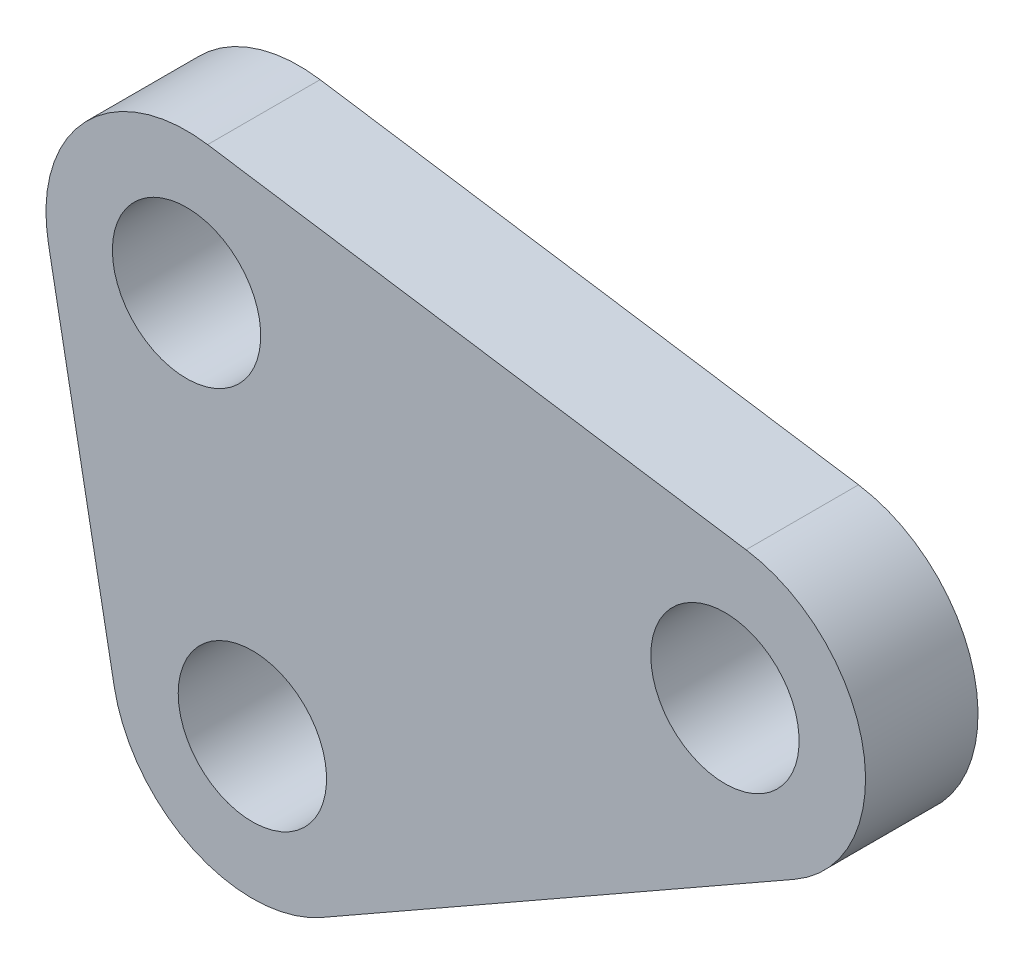
ISO-10303-21;
HEADER;
FILE_DESCRIPTION(('STEP AP214'),'2;1');
FILE_NAME('part.step','',(''),(''),'','','');
FILE_SCHEMA(('AUTOMOTIVE_DESIGN { 1 0 10303 214 1 1 1 1 }'));
ENDSEC;
DATA;
#1=APPLICATION_CONTEXT('core data for automotive mechanical design processes');
#2=APPLICATION_PROTOCOL_DEFINITION('international standard','automotive_design',2000,#1);
#3=PRODUCT_CONTEXT('',#1,'mechanical');
#4=PRODUCT('Part','Part','',(#3));
#5=PRODUCT_RELATED_PRODUCT_CATEGORY('part','',(#4));
#6=PRODUCT_DEFINITION_FORMATION('','',#4);
#7=PRODUCT_DEFINITION_CONTEXT('part definition',#1,'design');
#8=PRODUCT_DEFINITION('design','',#6,#7);
#9=PRODUCT_DEFINITION_SHAPE('','',#8);
#10=(LENGTH_UNIT() NAMED_UNIT(*) SI_UNIT(.MILLI.,.METRE.));
#11=(NAMED_UNIT(*) PLANE_ANGLE_UNIT() SI_UNIT($,.RADIAN.));
#12=(NAMED_UNIT(*) SI_UNIT($,.STERADIAN.) SOLID_ANGLE_UNIT());
#13=UNCERTAINTY_MEASURE_WITH_UNIT(LENGTH_MEASURE(1.E-05),#10,'distance_accuracy_value','');
#14=(GEOMETRIC_REPRESENTATION_CONTEXT(3) GLOBAL_UNCERTAINTY_ASSIGNED_CONTEXT((#13)) GLOBAL_UNIT_ASSIGNED_CONTEXT((#10,
#11,#12)) REPRESENTATION_CONTEXT('',''));
#15=CARTESIAN_POINT('',(0.,0.,0.));
#16=DIRECTION('',(0.,0.,1.));
#17=DIRECTION('',(1.,0.,0.));
#18=AXIS2_PLACEMENT_3D('',#15,#16,#17);
#19=CARTESIAN_POINT('',(45.2881051723479,69.194775027858,0.));
#20=DIRECTION('',(0.,0.,1.));
#21=DIRECTION('',(1.,0.,0.));
#22=AXIS2_PLACEMENT_3D('',#19,#20,#21);
#23=CYLINDRICAL_SURFACE('',#22,5.00000000000001);
#24=CARTESIAN_POINT('',(45.2881051723479,69.194775027858,4.));
#25=DIRECTION('',(0.,0.,1.));
#26=DIRECTION('',(1.,0.,0.));
#27=AXIS2_PLACEMENT_3D('',#24,#25,#26);
#28=CIRCLE('',#27,5.00000000000001);
#29=CARTESIAN_POINT('',(47.7635886864171,64.8505856475972,4.));
#30=VERTEX_POINT('',#29);
#31=CARTESIAN_POINT('',(46.0379881850551,74.1382227586683,4.));
#32=VERTEX_POINT('',#31);
#33=EDGE_CURVE('E117',#30,#32,#28,.T.);
#34=ORIENTED_EDGE('',*,*,#33,.F.);
#35=DIRECTION('',(0.,0.,1.));
#36=VECTOR('',#35,1.);
#37=CARTESIAN_POINT('',(47.7635886864171,64.8505856475972,0.));
#38=LINE('',#37,#36);
#39=CARTESIAN_POINT('',(47.7635886864171,64.8505856475972,0.));
#40=VERTEX_POINT('',#39);
#41=EDGE_CURVE('E11',#40,#30,#38,.T.);
#42=ORIENTED_EDGE('',*,*,#41,.F.);
#43=CARTESIAN_POINT('',(45.2881051723479,69.194775027858,0.));
#44=DIRECTION('',(0.,0.,1.));
#45=DIRECTION('',(1.,0.,0.));
#46=AXIS2_PLACEMENT_3D('',#43,#44,#45);
#47=CIRCLE('',#46,5.00000000000001);
#48=CARTESIAN_POINT('',(46.0379881850551,74.1382227586683,0.));
#49=VERTEX_POINT('',#48);
#50=EDGE_CURVE('E132',#40,#49,#47,.T.);
#51=ORIENTED_EDGE('',*,*,#50,.T.);
#52=DIRECTION('',(0.,0.,1.));
#53=VECTOR('',#52,1.);
#54=CARTESIAN_POINT('',(46.0379881850551,74.1382227586683,0.));
#55=LINE('',#54,#53);
#56=EDGE_CURVE('E35',#49,#32,#55,.T.);
#57=ORIENTED_EDGE('',*,*,#56,.T.);
#58=EDGE_LOOP('',(#34,#42,#51,#57));
#59=FACE_BOUND('',#58,.T.);
#60=ADVANCED_FACE('F32',(#59),#23,.T.);
#61=CARTESIAN_POINT('',(30.9580435209812,55.2741500089913,0.));
#62=DIRECTION('',(0.495096702813856,-0.868837876052171,0.));
#63=DIRECTION('',(0.868837876052171,0.495096702813856,0.));
#64=AXIS2_PLACEMENT_3D('',#61,#62,#63);
#65=PLANE('',#64);
#66=DIRECTION('',(0.868837876052171,0.495096702813856,0.));
#67=VECTOR('',#66,1.);
#68=CARTESIAN_POINT('',(30.9580435209812,55.2741500089913,4.));
#69=LINE('',#68,#67);
#70=CARTESIAN_POINT('',(30.9580435209812,55.2741500089913,4.));
#71=VERTEX_POINT('',#70);
#72=EDGE_CURVE('E130',#71,#30,#69,.T.);
#73=ORIENTED_EDGE('',*,*,#72,.F.);
#74=DIRECTION('',(0.,0.,1.));
#75=VECTOR('',#74,1.);
#76=CARTESIAN_POINT('',(30.9580435209812,55.2741500089913,0.));
#77=LINE('',#76,#75);
#78=CARTESIAN_POINT('',(30.9580435209812,55.2741500089913,0.));
#79=VERTEX_POINT('',#78);
#80=EDGE_CURVE('E41',#79,#71,#77,.T.);
#81=ORIENTED_EDGE('',*,*,#80,.F.);
#82=DIRECTION('',(0.868837876052171,0.495096702813856,0.));
#83=VECTOR('',#82,1.);
#84=CARTESIAN_POINT('',(30.9580435209812,55.2741500089913,0.));
#85=LINE('',#84,#83);
#86=EDGE_CURVE('E107',#79,#40,#85,.T.);
#87=ORIENTED_EDGE('',*,*,#86,.T.);
#88=ORIENTED_EDGE('',*,*,#41,.T.);
#89=EDGE_LOOP('',(#73,#81,#87,#88));
#90=FACE_BOUND('',#89,.T.);
#91=ADVANCED_FACE('F140',(#90),#65,.T.);
#92=CARTESIAN_POINT('',(28.4825600069119,59.6183393892521,0.));
#93=DIRECTION('',(0.,0.,1.));
#94=DIRECTION('',(1.,0.,0.));
#95=AXIS2_PLACEMENT_3D('',#92,#93,#94);
#96=CYLINDRICAL_SURFACE('',#95,4.99999999999993);
#97=CARTESIAN_POINT('',(28.4825600069119,59.6183393892521,4.));
#98=DIRECTION('',(0.,0.,1.));
#99=DIRECTION('',(1.,0.,0.));
#100=AXIS2_PLACEMENT_3D('',#97,#98,#99);
#101=CIRCLE('',#100,4.99999999999993);
#102=CARTESIAN_POINT('',(23.5682492589573,58.6966290917417,4.));
#103=VERTEX_POINT('',#102);
#104=EDGE_CURVE('E94',#103,#71,#101,.T.);
#105=ORIENTED_EDGE('',*,*,#104,.F.);
#106=DIRECTION('',(0.,0.,1.));
#107=VECTOR('',#106,1.);
#108=CARTESIAN_POINT('',(23.5682492589573,58.6966290917417,0.));
#109=LINE('',#108,#107);
#110=CARTESIAN_POINT('',(23.5682492589573,58.6966290917417,0.));
#111=VERTEX_POINT('',#110);
#112=EDGE_CURVE('E89',#111,#103,#109,.T.);
#113=ORIENTED_EDGE('',*,*,#112,.F.);
#114=CARTESIAN_POINT('',(28.4825600069119,59.6183393892521,0.));
#115=DIRECTION('',(0.,0.,1.));
#116=DIRECTION('',(1.,0.,0.));
#117=AXIS2_PLACEMENT_3D('',#114,#115,#116);
#118=CIRCLE('',#117,4.99999999999993);
#119=EDGE_CURVE('E92',#111,#79,#118,.T.);
#120=ORIENTED_EDGE('',*,*,#119,.T.);
#121=ORIENTED_EDGE('',*,*,#80,.T.);
#122=EDGE_LOOP('',(#105,#113,#120,#121));
#123=FACE_BOUND('',#122,.T.);
#124=ADVANCED_FACE('F91',(#123),#96,.T.);
#125=CARTESIAN_POINT('',(21.227396240506,71.1774261263712,0.));
#126=DIRECTION('',(-0.982862149590939,-0.184342059502107,0.));
#127=DIRECTION('',(0.184342059502107,-0.982862149590939,0.));
#128=AXIS2_PLACEMENT_3D('',#125,#126,#127);
#129=PLANE('',#128);
#130=DIRECTION('',(0.184342059502107,-0.982862149590939,0.));
#131=VECTOR('',#130,1.);
#132=CARTESIAN_POINT('',(21.227396240506,71.1774261263712,4.));
#133=LINE('',#132,#131);
#134=CARTESIAN_POINT('',(21.227396240506,71.1774261263712,4.));
#135=VERTEX_POINT('',#134);
#136=EDGE_CURVE('E127',#135,#103,#133,.T.);
#137=ORIENTED_EDGE('',*,*,#136,.F.);
#138=DIRECTION('',(0.,0.,1.));
#139=VECTOR('',#138,1.);
#140=CARTESIAN_POINT('',(21.227396240506,71.1774261263712,0.));
#141=LINE('',#140,#139);
#142=CARTESIAN_POINT('',(21.227396240506,71.1774261263712,0.));
#143=VERTEX_POINT('',#142);
#144=EDGE_CURVE('E99',#143,#135,#141,.T.);
#145=ORIENTED_EDGE('',*,*,#144,.F.);
#146=DIRECTION('',(0.184342059502107,-0.982862149590939,0.));
#147=VECTOR('',#146,1.);
#148=CARTESIAN_POINT('',(21.227396240506,71.1774261263712,0.));
#149=LINE('',#148,#147);
#150=EDGE_CURVE('E105',#143,#111,#149,.T.);
#151=ORIENTED_EDGE('',*,*,#150,.T.);
#152=ORIENTED_EDGE('',*,*,#112,.T.);
#153=EDGE_LOOP('',(#137,#145,#151,#152));
#154=FACE_BOUND('',#153,.T.);
#155=ADVANCED_FACE('F109',(#154),#129,.T.);
#156=CARTESIAN_POINT('',(26.1417069884607,72.0991364238817,0.));
#157=DIRECTION('',(0.,0.,1.));
#158=DIRECTION('',(1.,0.,0.));
#159=AXIS2_PLACEMENT_3D('',#156,#157,#158);
#160=CYLINDRICAL_SURFACE('',#159,5.);
#161=CARTESIAN_POINT('',(26.1417069884607,72.0991364238817,4.));
#162=DIRECTION('',(0.,0.,1.));
#163=DIRECTION('',(1.,0.,0.));
#164=AXIS2_PLACEMENT_3D('',#161,#162,#163);
#165=CIRCLE('',#164,5.);
#166=CARTESIAN_POINT('',(26.891590001168,77.042584154692,4.));
#167=VERTEX_POINT('',#166);
#168=EDGE_CURVE('E124',#167,#135,#165,.T.);
#169=ORIENTED_EDGE('',*,*,#168,.F.);
#170=DIRECTION('',(0.,0.,1.));
#171=VECTOR('',#170,1.);
#172=CARTESIAN_POINT('',(26.891590001168,77.042584154692,0.));
#173=LINE('',#172,#171);
#174=CARTESIAN_POINT('',(26.891590001168,77.042584154692,0.));
#175=VERTEX_POINT('',#174);
#176=EDGE_CURVE('E135',#175,#167,#173,.T.);
#177=ORIENTED_EDGE('',*,*,#176,.F.);
#178=CARTESIAN_POINT('',(26.1417069884607,72.0991364238817,0.));
#179=DIRECTION('',(0.,0.,1.));
#180=DIRECTION('',(1.,0.,0.));
#181=AXIS2_PLACEMENT_3D('',#178,#179,#180);
#182=CIRCLE('',#181,5.);
#183=EDGE_CURVE('E110',#175,#143,#182,.T.);
#184=ORIENTED_EDGE('',*,*,#183,.T.);
#185=ORIENTED_EDGE('',*,*,#144,.T.);
#186=EDGE_LOOP('',(#169,#177,#184,#185));
#187=FACE_BOUND('',#186,.T.);
#188=ADVANCED_FACE('F153',(#187),#160,.T.);
#189=CARTESIAN_POINT('',(46.0379881850551,74.1382227586683,0.));
#190=DIRECTION('',(0.14997660254145,0.988689546162052,0.));
#191=DIRECTION('',(-0.988689546162052,0.14997660254145,0.));
#192=AXIS2_PLACEMENT_3D('',#189,#190,#191);
#193=PLANE('',#192);
#194=DIRECTION('',(-0.988689546162052,0.14997660254145,0.));
#195=VECTOR('',#194,1.);
#196=CARTESIAN_POINT('',(46.0379881850551,74.1382227586683,4.));
#197=LINE('',#196,#195);
#198=EDGE_CURVE('E120',#32,#167,#197,.T.);
#199=ORIENTED_EDGE('',*,*,#198,.F.);
#200=ORIENTED_EDGE('',*,*,#56,.F.);
#201=DIRECTION('',(-0.988689546162052,0.14997660254145,0.));
#202=VECTOR('',#201,1.);
#203=CARTESIAN_POINT('',(46.0379881850551,74.1382227586683,0.));
#204=LINE('',#203,#202);
#205=EDGE_CURVE('E112',#49,#175,#204,.T.);
#206=ORIENTED_EDGE('',*,*,#205,.T.);
#207=ORIENTED_EDGE('',*,*,#176,.T.);
#208=EDGE_LOOP('',(#199,#200,#206,#207));
#209=FACE_BOUND('',#208,.T.);
#210=ADVANCED_FACE('F137',(#209),#193,.T.);
#211=CARTESIAN_POINT('',(45.2881051723479,69.194775027858,0.));
#212=DIRECTION('',(0.,0.,1.));
#213=DIRECTION('',(1.,0.,0.));
#214=AXIS2_PLACEMENT_3D('',#211,#212,#213);
#215=PLANE('',#214);
#216=CARTESIAN_POINT('',(28.4825600069119,59.6183393892521,0.));
#217=DIRECTION('',(0.,0.,1.));
#218=DIRECTION('',(-1.,0.,0.));
#219=AXIS2_PLACEMENT_3D('',#216,#217,#218);
#220=CIRCLE('',#219,2.6375);
#221=CARTESIAN_POINT('',(25.8450600069119,59.6183393892521,0.));
#222=VERTEX_POINT('',#221);
#223=EDGE_CURVE('E183',#222,#222,#220,.T.);
#224=ORIENTED_EDGE('',*,*,#223,.T.);
#225=EDGE_LOOP('',(#224));
#226=FACE_BOUND('',#225,.T.);
#227=CARTESIAN_POINT('',(26.1417069884607,72.0991364238817,0.));
#228=DIRECTION('',(0.,0.,1.));
#229=DIRECTION('',(-1.,0.,0.));
#230=AXIS2_PLACEMENT_3D('',#227,#228,#229);
#231=CIRCLE('',#230,2.6375);
#232=CARTESIAN_POINT('',(23.5042069884607,72.0991364238817,0.));
#233=VERTEX_POINT('',#232);
#234=EDGE_CURVE('E191',#233,#233,#231,.T.);
#235=ORIENTED_EDGE('',*,*,#234,.T.);
#236=EDGE_LOOP('',(#235));
#237=FACE_BOUND('',#236,.T.);
#238=CARTESIAN_POINT('',(45.2881051723479,69.194775027858,0.));
#239=DIRECTION('',(0.,0.,1.));
#240=DIRECTION('',(-1.,0.,0.));
#241=AXIS2_PLACEMENT_3D('',#238,#239,#240);
#242=CIRCLE('',#241,2.6375);
#243=CARTESIAN_POINT('',(42.6506051723479,69.194775027858,0.));
#244=VERTEX_POINT('',#243);
#245=EDGE_CURVE('E121',#244,#244,#242,.T.);
#246=ORIENTED_EDGE('',*,*,#245,.T.);
#247=EDGE_LOOP('',(#246));
#248=FACE_BOUND('',#247,.T.);
#249=ORIENTED_EDGE('',*,*,#50,.F.);
#250=ORIENTED_EDGE('',*,*,#86,.F.);
#251=ORIENTED_EDGE('',*,*,#119,.F.);
#252=ORIENTED_EDGE('',*,*,#150,.F.);
#253=ORIENTED_EDGE('',*,*,#183,.F.);
#254=ORIENTED_EDGE('',*,*,#205,.F.);
#255=EDGE_LOOP('',(#249,#250,#251,#252,#253,#254));
#256=FACE_BOUND('',#255,.T.);
#257=ADVANCED_FACE('F103',(#226,#237,#248,#256),#215,.F.);
#258=CARTESIAN_POINT('',(45.2881051723479,69.194775027858,4.));
#259=DIRECTION('',(0.,0.,1.));
#260=DIRECTION('',(1.,0.,0.));
#261=AXIS2_PLACEMENT_3D('',#258,#259,#260);
#262=PLANE('',#261);
#263=CARTESIAN_POINT('',(28.4825600069119,59.6183393892521,4.));
#264=DIRECTION('',(0.,0.,1.));
#265=DIRECTION('',(-1.,0.,0.));
#266=AXIS2_PLACEMENT_3D('',#263,#264,#265);
#267=CIRCLE('',#266,2.6375);
#268=CARTESIAN_POINT('',(25.8450600069119,59.6183393892521,4.));
#269=VERTEX_POINT('',#268);
#270=EDGE_CURVE('E186',#269,#269,#267,.T.);
#271=ORIENTED_EDGE('',*,*,#270,.F.);
#272=EDGE_LOOP('',(#271));
#273=FACE_BOUND('',#272,.T.);
#274=CARTESIAN_POINT('',(26.1417069884607,72.0991364238817,4.));
#275=DIRECTION('',(0.,0.,1.));
#276=DIRECTION('',(-1.,0.,0.));
#277=AXIS2_PLACEMENT_3D('',#274,#275,#276);
#278=CIRCLE('',#277,2.6375);
#279=CARTESIAN_POINT('',(23.5042069884607,72.0991364238817,4.));
#280=VERTEX_POINT('',#279);
#281=EDGE_CURVE('E188',#280,#280,#278,.T.);
#282=ORIENTED_EDGE('',*,*,#281,.F.);
#283=EDGE_LOOP('',(#282));
#284=FACE_BOUND('',#283,.T.);
#285=CARTESIAN_POINT('',(45.2881051723479,69.194775027858,4.));
#286=DIRECTION('',(0.,0.,1.));
#287=DIRECTION('',(-1.,0.,0.));
#288=AXIS2_PLACEMENT_3D('',#285,#286,#287);
#289=CIRCLE('',#288,2.6375);
#290=CARTESIAN_POINT('',(42.6506051723479,69.194775027858,4.));
#291=VERTEX_POINT('',#290);
#292=EDGE_CURVE('E194',#291,#291,#289,.T.);
#293=ORIENTED_EDGE('',*,*,#292,.F.);
#294=EDGE_LOOP('',(#293));
#295=FACE_BOUND('',#294,.T.);
#296=ORIENTED_EDGE('',*,*,#33,.T.);
#297=ORIENTED_EDGE('',*,*,#198,.T.);
#298=ORIENTED_EDGE('',*,*,#168,.T.);
#299=ORIENTED_EDGE('',*,*,#136,.T.);
#300=ORIENTED_EDGE('',*,*,#104,.T.);
#301=ORIENTED_EDGE('',*,*,#72,.T.);
#302=EDGE_LOOP('',(#296,#297,#298,#299,#300,#301));
#303=FACE_BOUND('',#302,.T.);
#304=ADVANCED_FACE('F139',(#273,#284,#295,#303),#262,.T.);
#305=CARTESIAN_POINT('',(45.2881051723479,69.194775027858,0.));
#306=DIRECTION('',(0.,0.,1.));
#307=DIRECTION('',(1.,0.,0.));
#308=AXIS2_PLACEMENT_3D('',#305,#306,#307);
#309=CYLINDRICAL_SURFACE('',#308,2.6375);
#310=ORIENTED_EDGE('',*,*,#245,.F.);
#311=EDGE_LOOP('',(#310));
#312=FACE_BOUND('',#311,.T.);
#313=ORIENTED_EDGE('',*,*,#292,.T.);
#314=EDGE_LOOP('',(#313));
#315=FACE_BOUND('',#314,.T.);
#316=ADVANCED_FACE('F164',(#312,#315),#309,.F.);
#317=CARTESIAN_POINT('',(26.1417069884607,72.0991364238817,0.));
#318=DIRECTION('',(0.,0.,1.));
#319=DIRECTION('',(1.,0.,0.));
#320=AXIS2_PLACEMENT_3D('',#317,#318,#319);
#321=CYLINDRICAL_SURFACE('',#320,2.6375);
#322=ORIENTED_EDGE('',*,*,#234,.F.);
#323=EDGE_LOOP('',(#322));
#324=FACE_BOUND('',#323,.T.);
#325=ORIENTED_EDGE('',*,*,#281,.T.);
#326=EDGE_LOOP('',(#325));
#327=FACE_BOUND('',#326,.T.);
#328=ADVANCED_FACE('F171',(#324,#327),#321,.F.);
#329=CARTESIAN_POINT('',(28.4825600069119,59.6183393892521,0.));
#330=DIRECTION('',(0.,0.,1.));
#331=DIRECTION('',(1.,0.,0.));
#332=AXIS2_PLACEMENT_3D('',#329,#330,#331);
#333=CYLINDRICAL_SURFACE('',#332,2.6375);
#334=ORIENTED_EDGE('',*,*,#223,.F.);
#335=EDGE_LOOP('',(#334));
#336=FACE_BOUND('',#335,.T.);
#337=ORIENTED_EDGE('',*,*,#270,.T.);
#338=EDGE_LOOP('',(#337));
#339=FACE_BOUND('',#338,.T.);
#340=ADVANCED_FACE('F175',(#336,#339),#333,.F.);
#341=CLOSED_SHELL('',(#60,#91,#124,#155,#188,#210,#257,#304,#316,#328,#340));
#342=MANIFOLD_SOLID_BREP('B2',#341);
#343=ADVANCED_BREP_SHAPE_REPRESENTATION('',(#18,#342),#14);
#344=SHAPE_DEFINITION_REPRESENTATION(#9,#343);
ENDSEC;
END-ISO-10303-21;
